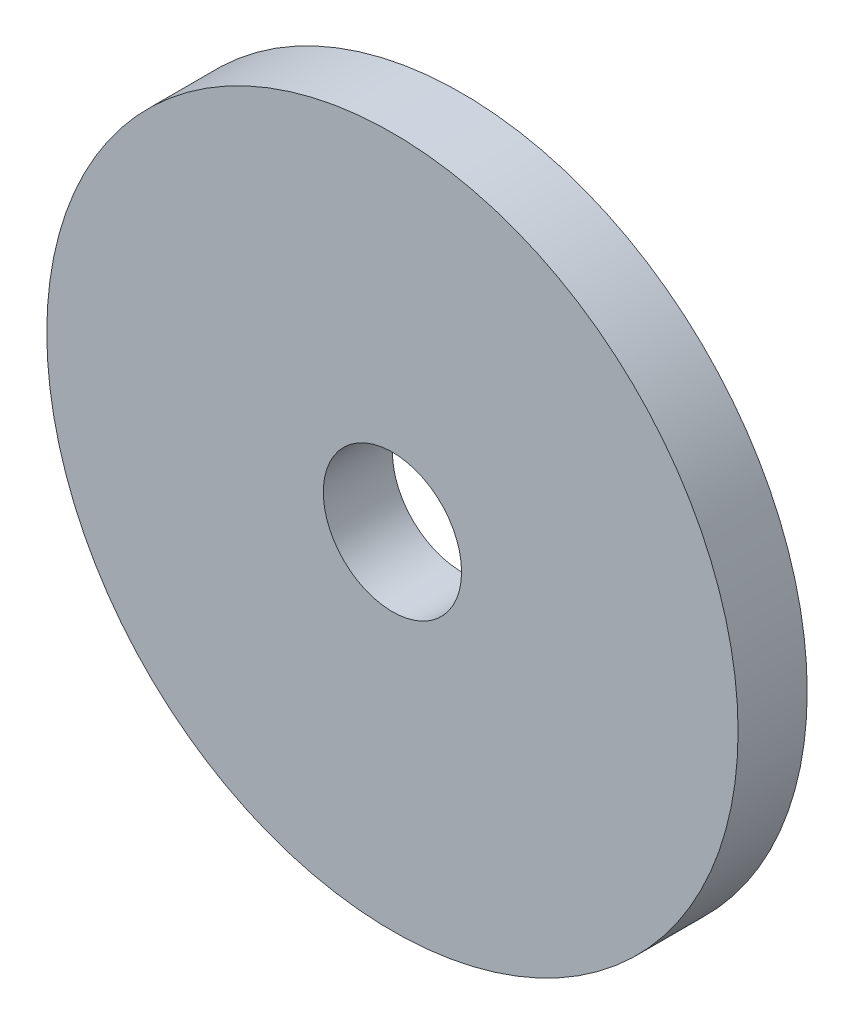
ISO-10303-21;
HEADER;
FILE_DESCRIPTION(('STEP AP214'),'2;1');
FILE_NAME('part.step','',(''),(''),'','','');
FILE_SCHEMA(('AUTOMOTIVE_DESIGN { 1 0 10303 214 1 1 1 1 }'));
ENDSEC;
DATA;
#1=APPLICATION_CONTEXT('core data for automotive mechanical design processes');
#2=APPLICATION_PROTOCOL_DEFINITION('international standard','automotive_design',2000,#1);
#3=PRODUCT_CONTEXT('',#1,'mechanical');
#4=PRODUCT('Part','Part','',(#3));
#5=PRODUCT_RELATED_PRODUCT_CATEGORY('part','',(#4));
#6=PRODUCT_DEFINITION_FORMATION('','',#4);
#7=PRODUCT_DEFINITION_CONTEXT('part definition',#1,'design');
#8=PRODUCT_DEFINITION('design','',#6,#7);
#9=PRODUCT_DEFINITION_SHAPE('','',#8);
#10=(LENGTH_UNIT() NAMED_UNIT(*) SI_UNIT(.MILLI.,.METRE.));
#11=(NAMED_UNIT(*) PLANE_ANGLE_UNIT() SI_UNIT($,.RADIAN.));
#12=(NAMED_UNIT(*) SI_UNIT($,.STERADIAN.) SOLID_ANGLE_UNIT());
#13=UNCERTAINTY_MEASURE_WITH_UNIT(LENGTH_MEASURE(1.E-05),#10,'distance_accuracy_value','');
#14=(GEOMETRIC_REPRESENTATION_CONTEXT(3) GLOBAL_UNCERTAINTY_ASSIGNED_CONTEXT((#13)) GLOBAL_UNIT_ASSIGNED_CONTEXT((#10,
#11,#12)) REPRESENTATION_CONTEXT('',''));
#15=CARTESIAN_POINT('',(0.,0.,0.));
#16=DIRECTION('',(0.,0.,1.));
#17=DIRECTION('',(1.,0.,0.));
#18=AXIS2_PLACEMENT_3D('',#15,#16,#17);
#19=CARTESIAN_POINT('',(0.,0.,10.));
#20=DIRECTION('',(0.,0.,1.));
#21=DIRECTION('',(1.,0.,0.));
#22=AXIS2_PLACEMENT_3D('',#19,#20,#21);
#23=PLANE('',#22);
#24=CARTESIAN_POINT('',(0.,0.,10.));
#25=DIRECTION('',(0.,0.,1.));
#26=DIRECTION('',(1.,0.,0.));
#27=AXIS2_PLACEMENT_3D('',#24,#25,#26);
#28=CIRCLE('',#27,50.);
#29=CARTESIAN_POINT('',(50.,0.,10.));
#30=VERTEX_POINT('',#29);
#31=EDGE_CURVE('E10',#30,#30,#28,.T.);
#32=ORIENTED_EDGE('',*,*,#31,.T.);
#33=EDGE_LOOP('',(#32));
#34=FACE_BOUND('',#33,.T.);
#35=CARTESIAN_POINT('',(0.,0.,10.));
#36=DIRECTION('',(0.,0.,1.));
#37=DIRECTION('',(1.,0.,0.));
#38=AXIS2_PLACEMENT_3D('',#35,#36,#37);
#39=CIRCLE('',#38,10.);
#40=CARTESIAN_POINT('',(10.,0.,10.));
#41=VERTEX_POINT('',#40);
#42=EDGE_CURVE('E44',#41,#41,#39,.T.);
#43=ORIENTED_EDGE('',*,*,#42,.F.);
#44=EDGE_LOOP('',(#43));
#45=FACE_BOUND('',#44,.T.);
#46=ADVANCED_FACE('F33',(#34,#45),#23,.T.);
#47=CARTESIAN_POINT('',(0.,0.,0.));
#48=DIRECTION('',(0.,0.,1.));
#49=DIRECTION('',(1.,0.,0.));
#50=AXIS2_PLACEMENT_3D('',#47,#48,#49);
#51=PLANE('',#50);
#52=CARTESIAN_POINT('',(0.,0.,0.));
#53=DIRECTION('',(0.,0.,1.));
#54=DIRECTION('',(1.,0.,0.));
#55=AXIS2_PLACEMENT_3D('',#52,#53,#54);
#56=CIRCLE('',#55,50.);
#57=CARTESIAN_POINT('',(50.,0.,0.));
#58=VERTEX_POINT('',#57);
#59=EDGE_CURVE('E37',#58,#58,#56,.T.);
#60=ORIENTED_EDGE('',*,*,#59,.F.);
#61=EDGE_LOOP('',(#60));
#62=FACE_BOUND('',#61,.T.);
#63=CARTESIAN_POINT('',(0.,0.,0.));
#64=DIRECTION('',(0.,0.,1.));
#65=DIRECTION('',(1.,0.,0.));
#66=AXIS2_PLACEMENT_3D('',#63,#64,#65);
#67=CIRCLE('',#66,10.);
#68=CARTESIAN_POINT('',(10.,0.,0.));
#69=VERTEX_POINT('',#68);
#70=EDGE_CURVE('E46',#69,#69,#67,.T.);
#71=ORIENTED_EDGE('',*,*,#70,.T.);
#72=EDGE_LOOP('',(#71));
#73=FACE_BOUND('',#72,.T.);
#74=ADVANCED_FACE('F56',(#62,#73),#51,.F.);
#75=CARTESIAN_POINT('',(0.,0.,10.));
#76=DIRECTION('',(0.,0.,-1.));
#77=DIRECTION('',(-1.,0.,0.));
#78=AXIS2_PLACEMENT_3D('',#75,#76,#77);
#79=CYLINDRICAL_SURFACE('',#78,50.);
#80=ORIENTED_EDGE('',*,*,#31,.F.);
#81=EDGE_LOOP('',(#80));
#82=FACE_BOUND('',#81,.T.);
#83=ORIENTED_EDGE('',*,*,#59,.T.);
#84=EDGE_LOOP('',(#83));
#85=FACE_BOUND('',#84,.T.);
#86=ADVANCED_FACE('F35',(#82,#85),#79,.T.);
#87=CARTESIAN_POINT('',(0.,0.,10.));
#88=DIRECTION('',(0.,0.,-1.));
#89=DIRECTION('',(-1.,0.,0.));
#90=AXIS2_PLACEMENT_3D('',#87,#88,#89);
#91=CYLINDRICAL_SURFACE('',#90,10.);
#92=ORIENTED_EDGE('',*,*,#42,.T.);
#93=EDGE_LOOP('',(#92));
#94=FACE_BOUND('',#93,.T.);
#95=ORIENTED_EDGE('',*,*,#70,.F.);
#96=EDGE_LOOP('',(#95));
#97=FACE_BOUND('',#96,.T.);
#98=ADVANCED_FACE('F52',(#94,#97),#91,.F.);
#99=CLOSED_SHELL('',(#46,#74,#86,#98));
#100=MANIFOLD_SOLID_BREP('B2',#99);
#101=ADVANCED_BREP_SHAPE_REPRESENTATION('',(#18,#100),#14);
#102=SHAPE_DEFINITION_REPRESENTATION(#9,#101);
ENDSEC;
END-ISO-10303-21;
